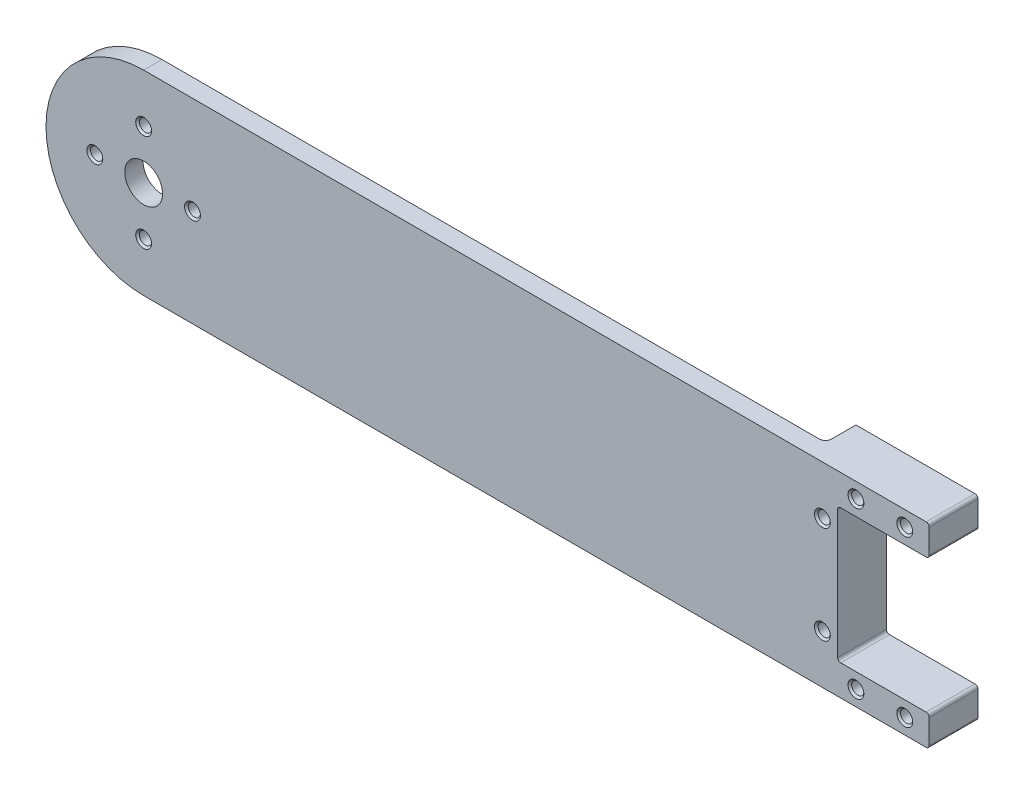
ISO-10303-21;
HEADER;
FILE_DESCRIPTION(('STEP AP214'),'2;1');
FILE_NAME('part.step','',(''),(''),'','','');
FILE_SCHEMA(('AUTOMOTIVE_DESIGN { 1 0 10303 214 1 1 1 1 }'));
ENDSEC;
DATA;
#1=APPLICATION_CONTEXT('core data for automotive mechanical design processes');
#2=APPLICATION_PROTOCOL_DEFINITION('international standard','automotive_design',2000,#1);
#3=PRODUCT_CONTEXT('',#1,'mechanical');
#4=PRODUCT('Part','Part','',(#3));
#5=PRODUCT_RELATED_PRODUCT_CATEGORY('part','',(#4));
#6=PRODUCT_DEFINITION_FORMATION('','',#4);
#7=PRODUCT_DEFINITION_CONTEXT('part definition',#1,'design');
#8=PRODUCT_DEFINITION('design','',#6,#7);
#9=PRODUCT_DEFINITION_SHAPE('','',#8);
#10=(LENGTH_UNIT() NAMED_UNIT(*) SI_UNIT(.MILLI.,.METRE.));
#11=(NAMED_UNIT(*) PLANE_ANGLE_UNIT() SI_UNIT($,.RADIAN.));
#12=(NAMED_UNIT(*) SI_UNIT($,.STERADIAN.) SOLID_ANGLE_UNIT());
#13=UNCERTAINTY_MEASURE_WITH_UNIT(LENGTH_MEASURE(1.E-05),#10,'distance_accuracy_value','');
#14=(GEOMETRIC_REPRESENTATION_CONTEXT(3) GLOBAL_UNCERTAINTY_ASSIGNED_CONTEXT((#13)) GLOBAL_UNIT_ASSIGNED_CONTEXT((#10,
#11,#12)) REPRESENTATION_CONTEXT('',''));
#15=CARTESIAN_POINT('',(0.,0.,0.));
#16=DIRECTION('',(0.,0.,1.));
#17=DIRECTION('',(1.,0.,0.));
#18=AXIS2_PLACEMENT_3D('',#15,#16,#17);
#19=CARTESIAN_POINT('',(0.,16.,3.));
#20=DIRECTION('',(0.,1.,0.));
#21=DIRECTION('',(0.,0.,1.));
#22=AXIS2_PLACEMENT_3D('',#19,#20,#21);
#23=PLANE('',#22);
#24=DIRECTION('',(1.,0.,0.));
#25=VECTOR('',#24,1.);
#26=CARTESIAN_POINT('',(0.,16.,3.));
#27=LINE('',#26,#25);
#28=CARTESIAN_POINT('',(-61.,16.,3.));
#29=VERTEX_POINT('',#28);
#30=CARTESIAN_POINT('',(67.1999999999998,16.,3.));
#31=VERTEX_POINT('',#30);
#32=EDGE_CURVE('E317',#29,#31,#27,.T.);
#33=ORIENTED_EDGE('',*,*,#32,.T.);
#34=DIRECTION('',(0.,0.,1.));
#35=VECTOR('',#34,1.);
#36=CARTESIAN_POINT('',(67.1999999999998,16.,-5.));
#37=LINE('',#36,#35);
#38=CARTESIAN_POINT('',(67.1999999999998,16.,-5.));
#39=VERTEX_POINT('',#38);
#40=EDGE_CURVE('E233',#31,#39,#37,.F.);
#41=ORIENTED_EDGE('',*,*,#40,.T.);
#42=DIRECTION('',(-1.,0.,0.));
#43=VECTOR('',#42,1.);
#44=CARTESIAN_POINT('',(0.,16.,-5.));
#45=LINE('',#44,#43);
#46=CARTESIAN_POINT('',(47.6999999999998,16.,-5.));
#47=VERTEX_POINT('',#46);
#48=EDGE_CURVE('E227',#39,#47,#45,.T.);
#49=ORIENTED_EDGE('',*,*,#48,.T.);
#50=DIRECTION('',(0.,0.,1.));
#51=VECTOR('',#50,1.);
#52=CARTESIAN_POINT('',(47.6999999999998,16.,-5.));
#53=LINE('',#52,#51);
#54=CARTESIAN_POINT('',(47.6999999999998,16.,-1.));
#55=VERTEX_POINT('',#54);
#56=EDGE_CURVE('E230',#47,#55,#53,.T.);
#57=ORIENTED_EDGE('',*,*,#56,.T.);
#58=CARTESIAN_POINT('',(46.6999999999998,16.,-1.));
#59=DIRECTION('',(0.,1.,0.));
#60=DIRECTION('',(0.,0.,1.));
#61=AXIS2_PLACEMENT_3D('',#58,#59,#60);
#62=CIRCLE('',#61,1.);
#63=CARTESIAN_POINT('',(46.6999999999998,16.,0.));
#64=VERTEX_POINT('',#63);
#65=EDGE_CURVE('E343',#55,#64,#62,.F.);
#66=ORIENTED_EDGE('',*,*,#65,.T.);
#67=DIRECTION('',(1.,0.,0.));
#68=VECTOR('',#67,1.);
#69=CARTESIAN_POINT('',(0.,16.,0.));
#70=LINE('',#69,#68);
#71=CARTESIAN_POINT('',(-61.,16.,0.));
#72=VERTEX_POINT('',#71);
#73=EDGE_CURVE('E324',#72,#64,#70,.T.);
#74=ORIENTED_EDGE('',*,*,#73,.F.);
#75=DIRECTION('',(0.,0.,-1.));
#76=VECTOR('',#75,1.);
#77=CARTESIAN_POINT('',(-61.,16.,3.));
#78=LINE('',#77,#76);
#79=EDGE_CURVE('E331',#29,#72,#78,.T.);
#80=ORIENTED_EDGE('',*,*,#79,.F.);
#81=EDGE_LOOP('',(#33,#41,#49,#57,#66,#74,#80));
#82=FACE_BOUND('',#81,.T.);
#83=ADVANCED_FACE('F108',(#82),#23,.T.);
#84=CARTESIAN_POINT('',(0.,-16.,3.));
#85=DIRECTION('',(0.,1.,0.));
#86=DIRECTION('',(0.,0.,1.));
#87=AXIS2_PLACEMENT_3D('',#84,#85,#86);
#88=PLANE('',#87);
#89=DIRECTION('',(1.,0.,0.));
#90=VECTOR('',#89,1.);
#91=CARTESIAN_POINT('',(0.,-16.,-5.));
#92=LINE('',#91,#90);
#93=CARTESIAN_POINT('',(47.6999999999998,-16.,-5.));
#94=VERTEX_POINT('',#93);
#95=CARTESIAN_POINT('',(67.1999999999998,-16.,-5.));
#96=VERTEX_POINT('',#95);
#97=EDGE_CURVE('E251',#94,#96,#92,.T.);
#98=ORIENTED_EDGE('',*,*,#97,.T.);
#99=DIRECTION('',(0.,0.,1.));
#100=VECTOR('',#99,1.);
#101=CARTESIAN_POINT('',(67.1999999999998,-16.,3.));
#102=LINE('',#101,#100);
#103=CARTESIAN_POINT('',(67.1999999999998,-16.,3.));
#104=VERTEX_POINT('',#103);
#105=EDGE_CURVE('E361',#96,#104,#102,.T.);
#106=ORIENTED_EDGE('',*,*,#105,.T.);
#107=DIRECTION('',(1.,0.,0.));
#108=VECTOR('',#107,1.);
#109=CARTESIAN_POINT('',(0.,-16.,3.));
#110=LINE('',#109,#108);
#111=CARTESIAN_POINT('',(-61.,-16.,3.));
#112=VERTEX_POINT('',#111);
#113=EDGE_CURVE('E319',#112,#104,#110,.T.);
#114=ORIENTED_EDGE('',*,*,#113,.F.);
#115=DIRECTION('',(0.,0.,-1.));
#116=VECTOR('',#115,1.);
#117=CARTESIAN_POINT('',(-61.,-16.,3.));
#118=LINE('',#117,#116);
#119=CARTESIAN_POINT('',(-61.,-16.,0.));
#120=VERTEX_POINT('',#119);
#121=EDGE_CURVE('E323',#112,#120,#118,.T.);
#122=ORIENTED_EDGE('',*,*,#121,.T.);
#123=DIRECTION('',(1.,0.,0.));
#124=VECTOR('',#123,1.);
#125=CARTESIAN_POINT('',(0.,-16.,0.));
#126=LINE('',#125,#124);
#127=CARTESIAN_POINT('',(46.6999999999998,-16.,0.));
#128=VERTEX_POINT('',#127);
#129=EDGE_CURVE('E320',#120,#128,#126,.T.);
#130=ORIENTED_EDGE('',*,*,#129,.T.);
#131=CARTESIAN_POINT('',(46.6999999999998,-16.,-1.));
#132=DIRECTION('',(0.,1.,0.));
#133=DIRECTION('',(0.,0.,1.));
#134=AXIS2_PLACEMENT_3D('',#131,#132,#133);
#135=CIRCLE('',#134,1.);
#136=CARTESIAN_POINT('',(47.6999999999998,-16.,-1.));
#137=VERTEX_POINT('',#136);
#138=EDGE_CURVE('E341',#128,#137,#135,.T.);
#139=ORIENTED_EDGE('',*,*,#138,.T.);
#140=DIRECTION('',(0.,0.,1.));
#141=VECTOR('',#140,1.);
#142=CARTESIAN_POINT('',(47.6999999999998,-16.,-5.));
#143=LINE('',#142,#141);
#144=EDGE_CURVE('E244',#94,#137,#143,.T.);
#145=ORIENTED_EDGE('',*,*,#144,.F.);
#146=EDGE_LOOP('',(#98,#106,#114,#122,#130,#139,#145));
#147=FACE_BOUND('',#146,.T.);
#148=ADVANCED_FACE('F534',(#147),#88,.F.);
#149=CARTESIAN_POINT('',(0.,0.,0.));
#150=DIRECTION('',(0.,0.,1.));
#151=DIRECTION('',(1.,0.,0.));
#152=AXIS2_PLACEMENT_3D('',#149,#150,#151);
#153=PLANE('',#152);
#154=CARTESIAN_POINT('',(-61.,8.,0.));
#155=DIRECTION('',(0.,0.,1.));
#156=DIRECTION('',(1.,0.,0.));
#157=AXIS2_PLACEMENT_3D('',#154,#155,#156);
#158=CIRCLE('',#157,1.);
#159=CARTESIAN_POINT('',(-60.,8.,0.));
#160=VERTEX_POINT('',#159);
#161=EDGE_CURVE('E280',#160,#160,#158,.T.);
#162=ORIENTED_EDGE('',*,*,#161,.T.);
#163=EDGE_LOOP('',(#162));
#164=FACE_BOUND('',#163,.T.);
#165=CARTESIAN_POINT('',(-53.,0.,0.));
#166=DIRECTION('',(0.,0.,1.));
#167=DIRECTION('',(1.,0.,0.));
#168=AXIS2_PLACEMENT_3D('',#165,#166,#167);
#169=CIRCLE('',#168,1.);
#170=CARTESIAN_POINT('',(-52.,0.,0.));
#171=VERTEX_POINT('',#170);
#172=EDGE_CURVE('E289',#171,#171,#169,.T.);
#173=ORIENTED_EDGE('',*,*,#172,.T.);
#174=EDGE_LOOP('',(#173));
#175=FACE_BOUND('',#174,.T.);
#176=CARTESIAN_POINT('',(-61.,-8.,0.));
#177=DIRECTION('',(0.,0.,1.));
#178=DIRECTION('',(1.,0.,0.));
#179=AXIS2_PLACEMENT_3D('',#176,#177,#178);
#180=CIRCLE('',#179,1.);
#181=CARTESIAN_POINT('',(-60.,-8.,0.));
#182=VERTEX_POINT('',#181);
#183=EDGE_CURVE('E298',#182,#182,#180,.T.);
#184=ORIENTED_EDGE('',*,*,#183,.T.);
#185=EDGE_LOOP('',(#184));
#186=FACE_BOUND('',#185,.T.);
#187=CARTESIAN_POINT('',(-69.,0.,0.));
#188=DIRECTION('',(0.,0.,1.));
#189=DIRECTION('',(1.,0.,0.));
#190=AXIS2_PLACEMENT_3D('',#187,#188,#189);
#191=CIRCLE('',#190,1.);
#192=CARTESIAN_POINT('',(-68.,0.,0.));
#193=VERTEX_POINT('',#192);
#194=EDGE_CURVE('E307',#193,#193,#191,.T.);
#195=ORIENTED_EDGE('',*,*,#194,.T.);
#196=EDGE_LOOP('',(#195));
#197=FACE_BOUND('',#196,.T.);
#198=CARTESIAN_POINT('',(-61.,0.,0.));
#199=DIRECTION('',(0.,0.,1.));
#200=DIRECTION('',(1.,0.,0.));
#201=AXIS2_PLACEMENT_3D('',#198,#199,#200);
#202=CIRCLE('',#201,3.1);
#203=CARTESIAN_POINT('',(-57.9,0.,0.));
#204=VERTEX_POINT('',#203);
#205=EDGE_CURVE('E311',#204,#204,#202,.T.);
#206=ORIENTED_EDGE('',*,*,#205,.T.);
#207=EDGE_LOOP('',(#206));
#208=FACE_BOUND('',#207,.T.);
#209=ORIENTED_EDGE('',*,*,#73,.T.);
#210=DIRECTION('',(0.,-1.,0.));
#211=VECTOR('',#210,1.);
#212=CARTESIAN_POINT('',(46.6999999999998,0.,0.));
#213=LINE('',#212,#211);
#214=EDGE_CURVE('E333',#64,#128,#213,.T.);
#215=ORIENTED_EDGE('',*,*,#214,.T.);
#216=ORIENTED_EDGE('',*,*,#129,.F.);
#217=CARTESIAN_POINT('',(-61.,0.,0.));
#218=DIRECTION('',(0.,0.,1.));
#219=DIRECTION('',(1.,0.,0.));
#220=AXIS2_PLACEMENT_3D('',#217,#218,#219);
#221=CIRCLE('',#220,16.);
#222=EDGE_CURVE('E314',#72,#120,#221,.T.);
#223=ORIENTED_EDGE('',*,*,#222,.F.);
#224=EDGE_LOOP('',(#209,#215,#216,#223));
#225=FACE_BOUND('',#224,.T.);
#226=ADVANCED_FACE('F506',(#164,#175,#186,#197,#208,#225),#153,.F.);
#227=CARTESIAN_POINT('',(0.,0.,3.));
#228=DIRECTION('',(0.,0.,1.));
#229=DIRECTION('',(1.,0.,0.));
#230=AXIS2_PLACEMENT_3D('',#227,#228,#229);
#231=PLANE('',#230);
#232=ORIENTED_EDGE('',*,*,#113,.T.);
#233=CARTESIAN_POINT('',(67.1999999999998,-15.5,3.));
#234=DIRECTION('',(0.,0.,1.));
#235=DIRECTION('',(1.,0.,0.));
#236=AXIS2_PLACEMENT_3D('',#233,#234,#235);
#237=CIRCLE('',#236,0.5);
#238=CARTESIAN_POINT('',(67.6999999999998,-15.5,3.));
#239=VERTEX_POINT('',#238);
#240=EDGE_CURVE('E370',#104,#239,#237,.T.);
#241=ORIENTED_EDGE('',*,*,#240,.T.);
#242=DIRECTION('',(0.,-1.,0.));
#243=VECTOR('',#242,1.);
#244=CARTESIAN_POINT('',(67.6999999999998,16.,3.));
#245=LINE('',#244,#243);
#246=CARTESIAN_POINT('',(67.6999999999998,-11.5,3.));
#247=VERTEX_POINT('',#246);
#248=EDGE_CURVE('E434',#247,#239,#245,.T.);
#249=ORIENTED_EDGE('',*,*,#248,.F.);
#250=CARTESIAN_POINT('',(67.1999999999998,-11.5,3.));
#251=DIRECTION('',(0.,0.,1.));
#252=DIRECTION('',(1.,0.,0.));
#253=AXIS2_PLACEMENT_3D('',#250,#251,#252);
#254=CIRCLE('',#253,0.5);
#255=CARTESIAN_POINT('',(67.1999999999998,-11.,3.));
#256=VERTEX_POINT('',#255);
#257=EDGE_CURVE('E368',#247,#256,#254,.T.);
#258=ORIENTED_EDGE('',*,*,#257,.T.);
#259=DIRECTION('',(1.,0.,0.));
#260=VECTOR('',#259,1.);
#261=CARTESIAN_POINT('',(74.9999999999998,-11.,3.));
#262=LINE('',#261,#260);
#263=CARTESIAN_POINT('',(53.1999999999998,-11.,3.));
#264=VERTEX_POINT('',#263);
#265=EDGE_CURVE('E271',#264,#256,#262,.T.);
#266=ORIENTED_EDGE('',*,*,#265,.F.);
#267=CARTESIAN_POINT('',(53.1999999999998,-10.5,3.));
#268=DIRECTION('',(0.,0.,1.));
#269=DIRECTION('',(1.,0.,0.));
#270=AXIS2_PLACEMENT_3D('',#267,#268,#269);
#271=CIRCLE('',#270,0.5);
#272=CARTESIAN_POINT('',(52.6999999999998,-10.5,3.));
#273=VERTEX_POINT('',#272);
#274=EDGE_CURVE('E388',#264,#273,#271,.F.);
#275=ORIENTED_EDGE('',*,*,#274,.T.);
#276=DIRECTION('',(0.,-1.,0.));
#277=VECTOR('',#276,1.);
#278=CARTESIAN_POINT('',(52.6999999999998,11.,3.));
#279=LINE('',#278,#277);
#280=CARTESIAN_POINT('',(52.6999999999998,10.5,3.));
#281=VERTEX_POINT('',#280);
#282=EDGE_CURVE('E268',#281,#273,#279,.T.);
#283=ORIENTED_EDGE('',*,*,#282,.F.);
#284=CARTESIAN_POINT('',(53.1999999999998,10.5,3.));
#285=DIRECTION('',(0.,0.,1.));
#286=DIRECTION('',(1.,0.,0.));
#287=AXIS2_PLACEMENT_3D('',#284,#285,#286);
#288=CIRCLE('',#287,0.5);
#289=CARTESIAN_POINT('',(53.1999999999998,11.,3.));
#290=VERTEX_POINT('',#289);
#291=EDGE_CURVE('E116',#281,#290,#288,.F.);
#292=ORIENTED_EDGE('',*,*,#291,.T.);
#293=DIRECTION('',(-1.,0.,0.));
#294=VECTOR('',#293,1.);
#295=CARTESIAN_POINT('',(74.9999999999998,11.,3.));
#296=LINE('',#295,#294);
#297=CARTESIAN_POINT('',(67.1999999999998,11.,3.));
#298=VERTEX_POINT('',#297);
#299=EDGE_CURVE('E264',#298,#290,#296,.T.);
#300=ORIENTED_EDGE('',*,*,#299,.F.);
#301=CARTESIAN_POINT('',(67.1999999999998,11.5,3.));
#302=DIRECTION('',(0.,0.,1.));
#303=DIRECTION('',(1.,0.,0.));
#304=AXIS2_PLACEMENT_3D('',#301,#302,#303);
#305=CIRCLE('',#304,0.5);
#306=CARTESIAN_POINT('',(67.6999999999998,11.5,3.));
#307=VERTEX_POINT('',#306);
#308=EDGE_CURVE('E366',#298,#307,#305,.T.);
#309=ORIENTED_EDGE('',*,*,#308,.T.);
#310=CARTESIAN_POINT('',(67.6999999999998,15.5,3.));
#311=VERTEX_POINT('',#310);
#312=EDGE_CURVE('E431',#311,#307,#245,.T.);
#313=ORIENTED_EDGE('',*,*,#312,.F.);
#314=CARTESIAN_POINT('',(67.1999999999998,15.5,3.));
#315=DIRECTION('',(0.,0.,1.));
#316=DIRECTION('',(1.,0.,0.));
#317=AXIS2_PLACEMENT_3D('',#314,#315,#316);
#318=CIRCLE('',#317,0.5);
#319=EDGE_CURVE('E364',#311,#31,#318,.T.);
#320=ORIENTED_EDGE('',*,*,#319,.T.);
#321=ORIENTED_EDGE('',*,*,#32,.F.);
#322=CARTESIAN_POINT('',(-61.,0.,3.));
#323=DIRECTION('',(0.,0.,1.));
#324=DIRECTION('',(1.,0.,0.));
#325=AXIS2_PLACEMENT_3D('',#322,#323,#324);
#326=CIRCLE('',#325,16.);
#327=EDGE_CURVE('E327',#29,#112,#326,.T.);
#328=ORIENTED_EDGE('',*,*,#327,.T.);
#329=EDGE_LOOP('',(#232,#241,#249,#258,#266,#275,#283,#292,#300,#309,#313,#320,#321,#328));
#330=FACE_BOUND('',#329,.T.);
#331=CARTESIAN_POINT('',(63.6999999999998,13.5,3.));
#332=DIRECTION('',(0.,0.,1.));
#333=DIRECTION('',(1.,0.,0.));
#334=AXIS2_PLACEMENT_3D('',#331,#332,#333);
#335=CIRCLE('',#334,1.3);
#336=CARTESIAN_POINT('',(64.9999999999998,13.5,3.));
#337=VERTEX_POINT('',#336);
#338=EDGE_CURVE('E433',#337,#337,#335,.T.);
#339=ORIENTED_EDGE('',*,*,#338,.F.);
#340=EDGE_LOOP('',(#339));
#341=FACE_BOUND('',#340,.T.);
#342=CARTESIAN_POINT('',(55.6999999999998,13.5,3.));
#343=DIRECTION('',(0.,0.,1.));
#344=DIRECTION('',(1.,0.,0.));
#345=AXIS2_PLACEMENT_3D('',#342,#343,#344);
#346=CIRCLE('',#345,1.3);
#347=CARTESIAN_POINT('',(56.9999999999998,13.5,3.));
#348=VERTEX_POINT('',#347);
#349=EDGE_CURVE('E445',#348,#348,#346,.T.);
#350=ORIENTED_EDGE('',*,*,#349,.F.);
#351=EDGE_LOOP('',(#350));
#352=FACE_BOUND('',#351,.T.);
#353=CARTESIAN_POINT('',(50.1999999999998,8.,3.));
#354=DIRECTION('',(0.,0.,1.));
#355=DIRECTION('',(1.,0.,0.));
#356=AXIS2_PLACEMENT_3D('',#353,#354,#355);
#357=CIRCLE('',#356,1.3);
#358=CARTESIAN_POINT('',(51.4999999999998,8.,3.));
#359=VERTEX_POINT('',#358);
#360=EDGE_CURVE('E454',#359,#359,#357,.T.);
#361=ORIENTED_EDGE('',*,*,#360,.F.);
#362=EDGE_LOOP('',(#361));
#363=FACE_BOUND('',#362,.T.);
#364=CARTESIAN_POINT('',(50.1999999999998,-8.,3.));
#365=DIRECTION('',(0.,0.,1.));
#366=DIRECTION('',(1.,0.,0.));
#367=AXIS2_PLACEMENT_3D('',#364,#365,#366);
#368=CIRCLE('',#367,1.3);
#369=CARTESIAN_POINT('',(51.4999999999998,-8.,3.));
#370=VERTEX_POINT('',#369);
#371=EDGE_CURVE('E463',#370,#370,#368,.T.);
#372=ORIENTED_EDGE('',*,*,#371,.F.);
#373=EDGE_LOOP('',(#372));
#374=FACE_BOUND('',#373,.T.);
#375=CARTESIAN_POINT('',(55.6999999999998,-13.5,3.));
#376=DIRECTION('',(0.,0.,1.));
#377=DIRECTION('',(1.,0.,0.));
#378=AXIS2_PLACEMENT_3D('',#375,#376,#377);
#379=CIRCLE('',#378,1.3);
#380=CARTESIAN_POINT('',(56.9999999999998,-13.5,3.));
#381=VERTEX_POINT('',#380);
#382=EDGE_CURVE('E472',#381,#381,#379,.T.);
#383=ORIENTED_EDGE('',*,*,#382,.F.);
#384=EDGE_LOOP('',(#383));
#385=FACE_BOUND('',#384,.T.);
#386=CARTESIAN_POINT('',(63.6999999999998,-13.5,3.));
#387=DIRECTION('',(0.,0.,1.));
#388=DIRECTION('',(1.,0.,0.));
#389=AXIS2_PLACEMENT_3D('',#386,#387,#388);
#390=CIRCLE('',#389,1.3);
#391=CARTESIAN_POINT('',(64.9999999999998,-13.5,3.));
#392=VERTEX_POINT('',#391);
#393=EDGE_CURVE('E481',#392,#392,#390,.T.);
#394=ORIENTED_EDGE('',*,*,#393,.F.);
#395=EDGE_LOOP('',(#394));
#396=FACE_BOUND('',#395,.T.);
#397=CARTESIAN_POINT('',(-61.,8.,3.));
#398=DIRECTION('',(0.,0.,1.));
#399=DIRECTION('',(1.,0.,0.));
#400=AXIS2_PLACEMENT_3D('',#397,#398,#399);
#401=CIRCLE('',#400,1.3);
#402=CARTESIAN_POINT('',(-59.7,8.,3.));
#403=VERTEX_POINT('',#402);
#404=EDGE_CURVE('E274',#403,#403,#401,.T.);
#405=ORIENTED_EDGE('',*,*,#404,.F.);
#406=EDGE_LOOP('',(#405));
#407=FACE_BOUND('',#406,.T.);
#408=CARTESIAN_POINT('',(-53.,0.,3.));
#409=DIRECTION('',(0.,0.,1.));
#410=DIRECTION('',(1.,0.,0.));
#411=AXIS2_PLACEMENT_3D('',#408,#409,#410);
#412=CIRCLE('',#411,1.3);
#413=CARTESIAN_POINT('',(-51.7,0.,3.));
#414=VERTEX_POINT('',#413);
#415=EDGE_CURVE('E283',#414,#414,#412,.T.);
#416=ORIENTED_EDGE('',*,*,#415,.F.);
#417=EDGE_LOOP('',(#416));
#418=FACE_BOUND('',#417,.T.);
#419=CARTESIAN_POINT('',(-61.,-8.,3.));
#420=DIRECTION('',(0.,0.,1.));
#421=DIRECTION('',(1.,0.,0.));
#422=AXIS2_PLACEMENT_3D('',#419,#420,#421);
#423=CIRCLE('',#422,1.3);
#424=CARTESIAN_POINT('',(-59.7,-8.,3.));
#425=VERTEX_POINT('',#424);
#426=EDGE_CURVE('E292',#425,#425,#423,.T.);
#427=ORIENTED_EDGE('',*,*,#426,.F.);
#428=EDGE_LOOP('',(#427));
#429=FACE_BOUND('',#428,.T.);
#430=CARTESIAN_POINT('',(-69.,0.,3.));
#431=DIRECTION('',(0.,0.,1.));
#432=DIRECTION('',(1.,0.,0.));
#433=AXIS2_PLACEMENT_3D('',#430,#431,#432);
#434=CIRCLE('',#433,1.3);
#435=CARTESIAN_POINT('',(-67.7,0.,3.));
#436=VERTEX_POINT('',#435);
#437=EDGE_CURVE('E301',#436,#436,#434,.T.);
#438=ORIENTED_EDGE('',*,*,#437,.F.);
#439=EDGE_LOOP('',(#438));
#440=FACE_BOUND('',#439,.T.);
#441=CARTESIAN_POINT('',(-61.,0.,3.));
#442=DIRECTION('',(0.,0.,1.));
#443=DIRECTION('',(1.,0.,0.));
#444=AXIS2_PLACEMENT_3D('',#441,#442,#443);
#445=CIRCLE('',#444,3.1);
#446=CARTESIAN_POINT('',(-57.9,0.,3.));
#447=VERTEX_POINT('',#446);
#448=EDGE_CURVE('E310',#447,#447,#445,.T.);
#449=ORIENTED_EDGE('',*,*,#448,.F.);
#450=EDGE_LOOP('',(#449));
#451=FACE_BOUND('',#450,.T.);
#452=ADVANCED_FACE('F394',(#330,#341,#352,#363,#374,#385,#396,#407,#418,#429,#440,#451),#231,.T.);
#453=CARTESIAN_POINT('',(-61.,0.,3.));
#454=DIRECTION('',(0.,0.,-1.));
#455=DIRECTION('',(-1.,0.,0.));
#456=AXIS2_PLACEMENT_3D('',#453,#454,#455);
#457=CYLINDRICAL_SURFACE('',#456,16.);
#458=ORIENTED_EDGE('',*,*,#327,.F.);
#459=ORIENTED_EDGE('',*,*,#79,.T.);
#460=ORIENTED_EDGE('',*,*,#222,.T.);
#461=ORIENTED_EDGE('',*,*,#121,.F.);
#462=EDGE_LOOP('',(#458,#459,#460,#461));
#463=FACE_BOUND('',#462,.T.);
#464=ADVANCED_FACE('F505',(#463),#457,.T.);
#465=CARTESIAN_POINT('',(-61.,0.,0.));
#466=DIRECTION('',(0.,0.,1.));
#467=DIRECTION('',(1.,0.,0.));
#468=AXIS2_PLACEMENT_3D('',#465,#466,#467);
#469=CYLINDRICAL_SURFACE('',#468,3.1);
#470=ORIENTED_EDGE('',*,*,#205,.F.);
#471=EDGE_LOOP('',(#470));
#472=FACE_BOUND('',#471,.T.);
#473=ORIENTED_EDGE('',*,*,#448,.T.);
#474=EDGE_LOOP('',(#473));
#475=FACE_BOUND('',#474,.T.);
#476=ADVANCED_FACE('F518',(#472,#475),#469,.F.);
#477=CARTESIAN_POINT('',(-69.,0.,3.));
#478=DIRECTION('',(0.,0.,1.));
#479=DIRECTION('',(1.,0.,0.));
#480=AXIS2_PLACEMENT_3D('',#477,#478,#479);
#481=CYLINDRICAL_SURFACE('',#480,1.);
#482=ORIENTED_EDGE('',*,*,#194,.F.);
#483=EDGE_LOOP('',(#482));
#484=FACE_BOUND('',#483,.T.);
#485=CARTESIAN_POINT('',(-69.,0.,2.7));
#486=DIRECTION('',(0.,0.,1.));
#487=DIRECTION('',(1.,0.,0.));
#488=AXIS2_PLACEMENT_3D('',#485,#486,#487);
#489=CIRCLE('',#488,1.);
#490=CARTESIAN_POINT('',(-68.,0.,2.7));
#491=VERTEX_POINT('',#490);
#492=EDGE_CURVE('E304',#491,#491,#489,.T.);
#493=ORIENTED_EDGE('',*,*,#492,.T.);
#494=EDGE_LOOP('',(#493));
#495=FACE_BOUND('',#494,.T.);
#496=ADVANCED_FACE('F520',(#484,#495),#481,.F.);
#497=CARTESIAN_POINT('',(-69.,0.,3.));
#498=DIRECTION('',(0.,0.,1.));
#499=DIRECTION('',(1.,0.,0.));
#500=AXIS2_PLACEMENT_3D('',#497,#498,#499);
#501=CONICAL_SURFACE('',#500,1.3,0.785398163397437);
#502=ORIENTED_EDGE('',*,*,#492,.F.);
#503=EDGE_LOOP('',(#502));
#504=FACE_BOUND('',#503,.T.);
#505=ORIENTED_EDGE('',*,*,#437,.T.);
#506=EDGE_LOOP('',(#505));
#507=FACE_BOUND('',#506,.T.);
#508=ADVANCED_FACE('F527',(#504,#507),#501,.F.);
#509=CARTESIAN_POINT('',(-61.,-8.,3.));
#510=DIRECTION('',(0.,0.,1.));
#511=DIRECTION('',(1.,0.,0.));
#512=AXIS2_PLACEMENT_3D('',#509,#510,#511);
#513=CYLINDRICAL_SURFACE('',#512,1.);
#514=ORIENTED_EDGE('',*,*,#183,.F.);
#515=EDGE_LOOP('',(#514));
#516=FACE_BOUND('',#515,.T.);
#517=CARTESIAN_POINT('',(-61.,-8.,2.7));
#518=DIRECTION('',(0.,0.,1.));
#519=DIRECTION('',(1.,0.,0.));
#520=AXIS2_PLACEMENT_3D('',#517,#518,#519);
#521=CIRCLE('',#520,1.);
#522=CARTESIAN_POINT('',(-60.,-8.,2.7));
#523=VERTEX_POINT('',#522);
#524=EDGE_CURVE('E295',#523,#523,#521,.T.);
#525=ORIENTED_EDGE('',*,*,#524,.T.);
#526=EDGE_LOOP('',(#525));
#527=FACE_BOUND('',#526,.T.);
#528=ADVANCED_FACE('F594',(#516,#527),#513,.F.);
#529=CARTESIAN_POINT('',(-61.,-8.,3.));
#530=DIRECTION('',(0.,0.,1.));
#531=DIRECTION('',(1.,0.,0.));
#532=AXIS2_PLACEMENT_3D('',#529,#530,#531);
#533=CONICAL_SURFACE('',#532,1.3,0.785398163397448);
#534=ORIENTED_EDGE('',*,*,#524,.F.);
#535=EDGE_LOOP('',(#534));
#536=FACE_BOUND('',#535,.T.);
#537=ORIENTED_EDGE('',*,*,#426,.T.);
#538=EDGE_LOOP('',(#537));
#539=FACE_BOUND('',#538,.T.);
#540=ADVANCED_FACE('F599',(#536,#539),#533,.F.);
#541=CARTESIAN_POINT('',(-53.,0.,3.));
#542=DIRECTION('',(0.,0.,1.));
#543=DIRECTION('',(1.,0.,0.));
#544=AXIS2_PLACEMENT_3D('',#541,#542,#543);
#545=CYLINDRICAL_SURFACE('',#544,1.);
#546=ORIENTED_EDGE('',*,*,#172,.F.);
#547=EDGE_LOOP('',(#546));
#548=FACE_BOUND('',#547,.T.);
#549=CARTESIAN_POINT('',(-53.,0.,2.7));
#550=DIRECTION('',(0.,0.,1.));
#551=DIRECTION('',(1.,0.,0.));
#552=AXIS2_PLACEMENT_3D('',#549,#550,#551);
#553=CIRCLE('',#552,1.);
#554=CARTESIAN_POINT('',(-52.,0.,2.7));
#555=VERTEX_POINT('',#554);
#556=EDGE_CURVE('E286',#555,#555,#553,.T.);
#557=ORIENTED_EDGE('',*,*,#556,.T.);
#558=EDGE_LOOP('',(#557));
#559=FACE_BOUND('',#558,.T.);
#560=ADVANCED_FACE('F605',(#548,#559),#545,.F.);
#561=CARTESIAN_POINT('',(-53.,0.,3.));
#562=DIRECTION('',(0.,0.,1.));
#563=DIRECTION('',(1.,0.,0.));
#564=AXIS2_PLACEMENT_3D('',#561,#562,#563);
#565=CONICAL_SURFACE('',#564,1.3,0.785398163397448);
#566=ORIENTED_EDGE('',*,*,#556,.F.);
#567=EDGE_LOOP('',(#566));
#568=FACE_BOUND('',#567,.T.);
#569=ORIENTED_EDGE('',*,*,#415,.T.);
#570=EDGE_LOOP('',(#569));
#571=FACE_BOUND('',#570,.T.);
#572=ADVANCED_FACE('F609',(#568,#571),#565,.F.);
#573=CARTESIAN_POINT('',(-61.,8.,3.));
#574=DIRECTION('',(0.,0.,1.));
#575=DIRECTION('',(1.,0.,0.));
#576=AXIS2_PLACEMENT_3D('',#573,#574,#575);
#577=CYLINDRICAL_SURFACE('',#576,1.);
#578=ORIENTED_EDGE('',*,*,#161,.F.);
#579=EDGE_LOOP('',(#578));
#580=FACE_BOUND('',#579,.T.);
#581=CARTESIAN_POINT('',(-61.,8.,2.7));
#582=DIRECTION('',(0.,0.,1.));
#583=DIRECTION('',(1.,0.,0.));
#584=AXIS2_PLACEMENT_3D('',#581,#582,#583);
#585=CIRCLE('',#584,1.);
#586=CARTESIAN_POINT('',(-60.,8.,2.7));
#587=VERTEX_POINT('',#586);
#588=EDGE_CURVE('E277',#587,#587,#585,.T.);
#589=ORIENTED_EDGE('',*,*,#588,.T.);
#590=EDGE_LOOP('',(#589));
#591=FACE_BOUND('',#590,.T.);
#592=ADVANCED_FACE('F613',(#580,#591),#577,.F.);
#593=CARTESIAN_POINT('',(-61.,8.,3.));
#594=DIRECTION('',(0.,0.,1.));
#595=DIRECTION('',(1.,0.,0.));
#596=AXIS2_PLACEMENT_3D('',#593,#594,#595);
#597=CONICAL_SURFACE('',#596,1.3,0.785398163397448);
#598=ORIENTED_EDGE('',*,*,#588,.F.);
#599=EDGE_LOOP('',(#598));
#600=FACE_BOUND('',#599,.T.);
#601=ORIENTED_EDGE('',*,*,#404,.T.);
#602=EDGE_LOOP('',(#601));
#603=FACE_BOUND('',#602,.T.);
#604=ADVANCED_FACE('F617',(#600,#603),#597,.F.);
#605=CARTESIAN_POINT('',(74.9999999999998,-11.,0.));
#606=DIRECTION('',(0.,-1.,0.));
#607=DIRECTION('',(1.,0.,0.));
#608=AXIS2_PLACEMENT_3D('',#605,#606,#607);
#609=PLANE('',#608);
#610=DIRECTION('',(-1.,0.,0.));
#611=VECTOR('',#610,1.);
#612=CARTESIAN_POINT('',(0.,-11.,-5.));
#613=LINE('',#612,#611);
#614=CARTESIAN_POINT('',(67.1999999999998,-11.,-5.));
#615=VERTEX_POINT('',#614);
#616=CARTESIAN_POINT('',(53.1999999999998,-11.,-5.));
#617=VERTEX_POINT('',#616);
#618=EDGE_CURVE('E253',#615,#617,#613,.T.);
#619=ORIENTED_EDGE('',*,*,#618,.T.);
#620=DIRECTION('',(0.,0.,1.));
#621=VECTOR('',#620,1.);
#622=CARTESIAN_POINT('',(53.1999999999998,-11.,3.));
#623=LINE('',#622,#621);
#624=EDGE_CURVE('E348',#617,#264,#623,.T.);
#625=ORIENTED_EDGE('',*,*,#624,.T.);
#626=ORIENTED_EDGE('',*,*,#265,.T.);
#627=DIRECTION('',(0.,0.,-1.));
#628=VECTOR('',#627,1.);
#629=CARTESIAN_POINT('',(67.1999999999998,-11.,0.));
#630=LINE('',#629,#628);
#631=EDGE_CURVE('E345',#256,#615,#630,.T.);
#632=ORIENTED_EDGE('',*,*,#631,.T.);
#633=EDGE_LOOP('',(#619,#625,#626,#632));
#634=FACE_BOUND('',#633,.T.);
#635=ADVANCED_FACE('F415',(#634),#609,.F.);
#636=CARTESIAN_POINT('',(52.6999999999998,11.,0.));
#637=DIRECTION('',(-1.,0.,0.));
#638=DIRECTION('',(0.,-1.,0.));
#639=AXIS2_PLACEMENT_3D('',#636,#637,#638);
#640=PLANE('',#639);
#641=ORIENTED_EDGE('',*,*,#282,.T.);
#642=DIRECTION('',(0.,0.,1.));
#643=VECTOR('',#642,1.);
#644=CARTESIAN_POINT('',(52.6999999999998,-10.5,-5.));
#645=LINE('',#644,#643);
#646=CARTESIAN_POINT('',(52.6999999999998,-10.5,-5.));
#647=VERTEX_POINT('',#646);
#648=EDGE_CURVE('E354',#273,#647,#645,.F.);
#649=ORIENTED_EDGE('',*,*,#648,.T.);
#650=DIRECTION('',(0.,1.,0.));
#651=VECTOR('',#650,1.);
#652=CARTESIAN_POINT('',(52.6999999999998,0.,-5.));
#653=LINE('',#652,#651);
#654=CARTESIAN_POINT('',(52.6999999999998,10.5,-5.));
#655=VERTEX_POINT('',#654);
#656=EDGE_CURVE('E259',#647,#655,#653,.T.);
#657=ORIENTED_EDGE('',*,*,#656,.T.);
#658=DIRECTION('',(0.,0.,1.));
#659=VECTOR('',#658,1.);
#660=CARTESIAN_POINT('',(52.6999999999998,10.5,3.));
#661=LINE('',#660,#659);
#662=EDGE_CURVE('E351',#655,#281,#661,.T.);
#663=ORIENTED_EDGE('',*,*,#662,.T.);
#664=EDGE_LOOP('',(#641,#649,#657,#663));
#665=FACE_BOUND('',#664,.T.);
#666=ADVANCED_FACE('F408',(#665),#640,.F.);
#667=CARTESIAN_POINT('',(74.9999999999998,11.,0.));
#668=DIRECTION('',(0.,1.,0.));
#669=DIRECTION('',(-1.,0.,0.));
#670=AXIS2_PLACEMENT_3D('',#667,#668,#669);
#671=PLANE('',#670);
#672=ORIENTED_EDGE('',*,*,#299,.T.);
#673=DIRECTION('',(0.,0.,1.));
#674=VECTOR('',#673,1.);
#675=CARTESIAN_POINT('',(53.1999999999998,11.,-5.));
#676=LINE('',#675,#674);
#677=CARTESIAN_POINT('',(53.1999999999998,11.,-5.));
#678=VERTEX_POINT('',#677);
#679=EDGE_CURVE('E359',#290,#678,#676,.F.);
#680=ORIENTED_EDGE('',*,*,#679,.T.);
#681=DIRECTION('',(1.,0.,0.));
#682=VECTOR('',#681,1.);
#683=CARTESIAN_POINT('',(0.,11.,-5.));
#684=LINE('',#683,#682);
#685=CARTESIAN_POINT('',(67.1999999999998,11.,-5.));
#686=VERTEX_POINT('',#685);
#687=EDGE_CURVE('E245',#678,#686,#684,.T.);
#688=ORIENTED_EDGE('',*,*,#687,.T.);
#689=DIRECTION('',(0.,0.,1.));
#690=VECTOR('',#689,1.);
#691=CARTESIAN_POINT('',(67.1999999999998,11.,0.));
#692=LINE('',#691,#690);
#693=EDGE_CURVE('E356',#686,#298,#692,.T.);
#694=ORIENTED_EDGE('',*,*,#693,.T.);
#695=EDGE_LOOP('',(#672,#680,#688,#694));
#696=FACE_BOUND('',#695,.T.);
#697=ADVANCED_FACE('F400',(#696),#671,.F.);
#698=CARTESIAN_POINT('',(47.6999999999998,0.,-5.));
#699=DIRECTION('',(-1.,0.,0.));
#700=DIRECTION('',(0.,-1.,0.));
#701=AXIS2_PLACEMENT_3D('',#698,#699,#700);
#702=PLANE('',#701);
#703=ORIENTED_EDGE('',*,*,#144,.T.);
#704=DIRECTION('',(0.,-1.,0.));
#705=VECTOR('',#704,1.);
#706=CARTESIAN_POINT('',(47.6999999999998,0.,-1.));
#707=LINE('',#706,#705);
#708=EDGE_CURVE('E243',#137,#55,#707,.F.);
#709=ORIENTED_EDGE('',*,*,#708,.T.);
#710=ORIENTED_EDGE('',*,*,#56,.F.);
#711=DIRECTION('',(0.,-1.,0.));
#712=VECTOR('',#711,1.);
#713=CARTESIAN_POINT('',(47.6999999999998,0.,-5.));
#714=LINE('',#713,#712);
#715=EDGE_CURVE('E235',#47,#94,#714,.T.);
#716=ORIENTED_EDGE('',*,*,#715,.T.);
#717=EDGE_LOOP('',(#703,#709,#710,#716));
#718=FACE_BOUND('',#717,.T.);
#719=ADVANCED_FACE('F241',(#718),#702,.T.);
#720=CARTESIAN_POINT('',(0.,0.,-5.));
#721=DIRECTION('',(0.,0.,1.));
#722=DIRECTION('',(1.,0.,0.));
#723=AXIS2_PLACEMENT_3D('',#720,#721,#722);
#724=PLANE('',#723);
#725=CARTESIAN_POINT('',(63.6999999999998,13.5,-5.));
#726=DIRECTION('',(0.,0.,1.));
#727=DIRECTION('',(1.,0.,0.));
#728=AXIS2_PLACEMENT_3D('',#725,#726,#727);
#729=CIRCLE('',#728,1.);
#730=CARTESIAN_POINT('',(64.6999999999998,13.5,-5.));
#731=VERTEX_POINT('',#730);
#732=EDGE_CURVE('E442',#731,#731,#729,.T.);
#733=ORIENTED_EDGE('',*,*,#732,.T.);
#734=EDGE_LOOP('',(#733));
#735=FACE_BOUND('',#734,.T.);
#736=CARTESIAN_POINT('',(55.6999999999998,13.5,-5.));
#737=DIRECTION('',(0.,0.,1.));
#738=DIRECTION('',(1.,0.,0.));
#739=AXIS2_PLACEMENT_3D('',#736,#737,#738);
#740=CIRCLE('',#739,1.);
#741=CARTESIAN_POINT('',(56.6999999999998,13.5,-5.));
#742=VERTEX_POINT('',#741);
#743=EDGE_CURVE('E451',#742,#742,#740,.T.);
#744=ORIENTED_EDGE('',*,*,#743,.T.);
#745=EDGE_LOOP('',(#744));
#746=FACE_BOUND('',#745,.T.);
#747=CARTESIAN_POINT('',(50.1999999999998,8.,-5.));
#748=DIRECTION('',(0.,0.,1.));
#749=DIRECTION('',(1.,0.,0.));
#750=AXIS2_PLACEMENT_3D('',#747,#748,#749);
#751=CIRCLE('',#750,1.);
#752=CARTESIAN_POINT('',(51.1999999999998,8.,-5.));
#753=VERTEX_POINT('',#752);
#754=EDGE_CURVE('E460',#753,#753,#751,.T.);
#755=ORIENTED_EDGE('',*,*,#754,.T.);
#756=EDGE_LOOP('',(#755));
#757=FACE_BOUND('',#756,.T.);
#758=CARTESIAN_POINT('',(50.1999999999998,-8.,-5.));
#759=DIRECTION('',(0.,0.,1.));
#760=DIRECTION('',(1.,0.,0.));
#761=AXIS2_PLACEMENT_3D('',#758,#759,#760);
#762=CIRCLE('',#761,1.);
#763=CARTESIAN_POINT('',(51.1999999999998,-8.,-5.));
#764=VERTEX_POINT('',#763);
#765=EDGE_CURVE('E469',#764,#764,#762,.T.);
#766=ORIENTED_EDGE('',*,*,#765,.T.);
#767=EDGE_LOOP('',(#766));
#768=FACE_BOUND('',#767,.T.);
#769=CARTESIAN_POINT('',(55.6999999999998,-13.5,-5.));
#770=DIRECTION('',(0.,0.,1.));
#771=DIRECTION('',(1.,0.,0.));
#772=AXIS2_PLACEMENT_3D('',#769,#770,#771);
#773=CIRCLE('',#772,1.);
#774=CARTESIAN_POINT('',(56.6999999999998,-13.5,-5.));
#775=VERTEX_POINT('',#774);
#776=EDGE_CURVE('E478',#775,#775,#773,.T.);
#777=ORIENTED_EDGE('',*,*,#776,.T.);
#778=EDGE_LOOP('',(#777));
#779=FACE_BOUND('',#778,.T.);
#780=CARTESIAN_POINT('',(63.6999999999998,-13.5,-5.));
#781=DIRECTION('',(0.,0.,1.));
#782=DIRECTION('',(1.,0.,0.));
#783=AXIS2_PLACEMENT_3D('',#780,#781,#782);
#784=CIRCLE('',#783,1.);
#785=CARTESIAN_POINT('',(64.6999999999998,-13.5,-5.));
#786=VERTEX_POINT('',#785);
#787=EDGE_CURVE('E236',#786,#786,#784,.T.);
#788=ORIENTED_EDGE('',*,*,#787,.T.);
#789=EDGE_LOOP('',(#788));
#790=FACE_BOUND('',#789,.T.);
#791=DIRECTION('',(0.,-1.,0.));
#792=VECTOR('',#791,1.);
#793=CARTESIAN_POINT('',(67.6999999999998,16.,-5.));
#794=LINE('',#793,#792);
#795=CARTESIAN_POINT('',(67.6999999999998,-11.5,-5.));
#796=VERTEX_POINT('',#795);
#797=CARTESIAN_POINT('',(67.6999999999998,-15.5,-5.));
#798=VERTEX_POINT('',#797);
#799=EDGE_CURVE('E423',#796,#798,#794,.T.);
#800=ORIENTED_EDGE('',*,*,#799,.T.);
#801=CARTESIAN_POINT('',(67.1999999999998,-15.5,-5.));
#802=DIRECTION('',(0.,0.,1.));
#803=DIRECTION('',(1.,0.,0.));
#804=AXIS2_PLACEMENT_3D('',#801,#802,#803);
#805=CIRCLE('',#804,0.5);
#806=EDGE_CURVE('E381',#798,#96,#805,.F.);
#807=ORIENTED_EDGE('',*,*,#806,.T.);
#808=ORIENTED_EDGE('',*,*,#97,.F.);
#809=ORIENTED_EDGE('',*,*,#715,.F.);
#810=ORIENTED_EDGE('',*,*,#48,.F.);
#811=CARTESIAN_POINT('',(67.1999999999998,15.5,-5.));
#812=DIRECTION('',(0.,0.,1.));
#813=DIRECTION('',(1.,0.,0.));
#814=AXIS2_PLACEMENT_3D('',#811,#812,#813);
#815=CIRCLE('',#814,0.5);
#816=CARTESIAN_POINT('',(67.6999999999998,15.5,-5.));
#817=VERTEX_POINT('',#816);
#818=EDGE_CURVE('E130',#39,#817,#815,.F.);
#819=ORIENTED_EDGE('',*,*,#818,.T.);
#820=CARTESIAN_POINT('',(67.6999999999998,11.5,-5.));
#821=VERTEX_POINT('',#820);
#822=EDGE_CURVE('E430',#817,#821,#794,.T.);
#823=ORIENTED_EDGE('',*,*,#822,.T.);
#824=CARTESIAN_POINT('',(67.1999999999998,11.5,-5.));
#825=DIRECTION('',(0.,0.,1.));
#826=DIRECTION('',(1.,0.,0.));
#827=AXIS2_PLACEMENT_3D('',#824,#825,#826);
#828=CIRCLE('',#827,0.5);
#829=EDGE_CURVE('E377',#821,#686,#828,.F.);
#830=ORIENTED_EDGE('',*,*,#829,.T.);
#831=ORIENTED_EDGE('',*,*,#687,.F.);
#832=CARTESIAN_POINT('',(53.1999999999998,10.5,-5.));
#833=DIRECTION('',(0.,0.,1.));
#834=DIRECTION('',(1.,0.,0.));
#835=AXIS2_PLACEMENT_3D('',#832,#833,#834);
#836=CIRCLE('',#835,0.5);
#837=EDGE_CURVE('E12',#678,#655,#836,.T.);
#838=ORIENTED_EDGE('',*,*,#837,.T.);
#839=ORIENTED_EDGE('',*,*,#656,.F.);
#840=CARTESIAN_POINT('',(53.1999999999998,-10.5,-5.));
#841=DIRECTION('',(0.,0.,1.));
#842=DIRECTION('',(1.,0.,0.));
#843=AXIS2_PLACEMENT_3D('',#840,#841,#842);
#844=CIRCLE('',#843,0.5);
#845=EDGE_CURVE('E390',#647,#617,#844,.T.);
#846=ORIENTED_EDGE('',*,*,#845,.T.);
#847=ORIENTED_EDGE('',*,*,#618,.F.);
#848=CARTESIAN_POINT('',(67.1999999999998,-11.5,-5.));
#849=DIRECTION('',(0.,0.,1.));
#850=DIRECTION('',(1.,0.,0.));
#851=AXIS2_PLACEMENT_3D('',#848,#849,#850);
#852=CIRCLE('',#851,0.5);
#853=EDGE_CURVE('E379',#615,#796,#852,.F.);
#854=ORIENTED_EDGE('',*,*,#853,.T.);
#855=EDGE_LOOP('',(#800,#807,#808,#809,#810,#819,#823,#830,#831,#838,#839,#846,#847,#854));
#856=FACE_BOUND('',#855,.T.);
#857=ADVANCED_FACE('F249',(#735,#746,#757,#768,#779,#790,#856),#724,.F.);
#858=CARTESIAN_POINT('',(63.6999999999998,-13.5,3.));
#859=DIRECTION('',(0.,0.,1.));
#860=DIRECTION('',(1.,0.,0.));
#861=AXIS2_PLACEMENT_3D('',#858,#859,#860);
#862=CYLINDRICAL_SURFACE('',#861,1.);
#863=ORIENTED_EDGE('',*,*,#787,.F.);
#864=EDGE_LOOP('',(#863));
#865=FACE_BOUND('',#864,.T.);
#866=CARTESIAN_POINT('',(63.6999999999998,-13.5,2.7));
#867=DIRECTION('',(0.,0.,1.));
#868=DIRECTION('',(1.,0.,0.));
#869=AXIS2_PLACEMENT_3D('',#866,#867,#868);
#870=CIRCLE('',#869,1.);
#871=CARTESIAN_POINT('',(64.6999999999998,-13.5,2.7));
#872=VERTEX_POINT('',#871);
#873=EDGE_CURVE('E484',#872,#872,#870,.T.);
#874=ORIENTED_EDGE('',*,*,#873,.T.);
#875=EDGE_LOOP('',(#874));
#876=FACE_BOUND('',#875,.T.);
#877=ADVANCED_FACE('F490',(#865,#876),#862,.F.);
#878=CARTESIAN_POINT('',(63.6999999999998,-13.5,3.));
#879=DIRECTION('',(0.,0.,1.));
#880=DIRECTION('',(1.,0.,0.));
#881=AXIS2_PLACEMENT_3D('',#878,#879,#880);
#882=CONICAL_SURFACE('',#881,1.3,0.785398163397434);
#883=ORIENTED_EDGE('',*,*,#873,.F.);
#884=EDGE_LOOP('',(#883));
#885=FACE_BOUND('',#884,.T.);
#886=ORIENTED_EDGE('',*,*,#393,.T.);
#887=EDGE_LOOP('',(#886));
#888=FACE_BOUND('',#887,.T.);
#889=ADVANCED_FACE('F493',(#885,#888),#882,.F.);
#890=CARTESIAN_POINT('',(55.6999999999998,-13.5,3.));
#891=DIRECTION('',(0.,0.,1.));
#892=DIRECTION('',(1.,0.,0.));
#893=AXIS2_PLACEMENT_3D('',#890,#891,#892);
#894=CYLINDRICAL_SURFACE('',#893,1.);
#895=ORIENTED_EDGE('',*,*,#776,.F.);
#896=EDGE_LOOP('',(#895));
#897=FACE_BOUND('',#896,.T.);
#898=CARTESIAN_POINT('',(55.6999999999998,-13.5,2.7));
#899=DIRECTION('',(0.,0.,1.));
#900=DIRECTION('',(1.,0.,0.));
#901=AXIS2_PLACEMENT_3D('',#898,#899,#900);
#902=CIRCLE('',#901,1.);
#903=CARTESIAN_POINT('',(56.6999999999998,-13.5,2.7));
#904=VERTEX_POINT('',#903);
#905=EDGE_CURVE('E475',#904,#904,#902,.T.);
#906=ORIENTED_EDGE('',*,*,#905,.T.);
#907=EDGE_LOOP('',(#906));
#908=FACE_BOUND('',#907,.T.);
#909=ADVANCED_FACE('F499',(#897,#908),#894,.F.);
#910=CARTESIAN_POINT('',(55.6999999999998,-13.5,3.));
#911=DIRECTION('',(0.,0.,1.));
#912=DIRECTION('',(1.,0.,0.));
#913=AXIS2_PLACEMENT_3D('',#910,#911,#912);
#914=CONICAL_SURFACE('',#913,1.3,0.785398163397445);
#915=ORIENTED_EDGE('',*,*,#905,.F.);
#916=EDGE_LOOP('',(#915));
#917=FACE_BOUND('',#916,.T.);
#918=ORIENTED_EDGE('',*,*,#382,.T.);
#919=EDGE_LOOP('',(#918));
#920=FACE_BOUND('',#919,.T.);
#921=ADVANCED_FACE('F635',(#917,#920),#914,.F.);
#922=CARTESIAN_POINT('',(50.1999999999998,-8.,3.));
#923=DIRECTION('',(0.,0.,1.));
#924=DIRECTION('',(1.,0.,0.));
#925=AXIS2_PLACEMENT_3D('',#922,#923,#924);
#926=CYLINDRICAL_SURFACE('',#925,1.);
#927=ORIENTED_EDGE('',*,*,#765,.F.);
#928=EDGE_LOOP('',(#927));
#929=FACE_BOUND('',#928,.T.);
#930=CARTESIAN_POINT('',(50.1999999999998,-8.,2.7));
#931=DIRECTION('',(0.,0.,1.));
#932=DIRECTION('',(1.,0.,0.));
#933=AXIS2_PLACEMENT_3D('',#930,#931,#932);
#934=CIRCLE('',#933,1.);
#935=CARTESIAN_POINT('',(51.1999999999998,-8.,2.7));
#936=VERTEX_POINT('',#935);
#937=EDGE_CURVE('E466',#936,#936,#934,.T.);
#938=ORIENTED_EDGE('',*,*,#937,.T.);
#939=EDGE_LOOP('',(#938));
#940=FACE_BOUND('',#939,.T.);
#941=ADVANCED_FACE('F639',(#929,#940),#926,.F.);
#942=CARTESIAN_POINT('',(50.1999999999998,-8.,3.));
#943=DIRECTION('',(0.,0.,1.));
#944=DIRECTION('',(1.,0.,0.));
#945=AXIS2_PLACEMENT_3D('',#942,#943,#944);
#946=CONICAL_SURFACE('',#945,1.3,0.785398163397445);
#947=ORIENTED_EDGE('',*,*,#937,.F.);
#948=EDGE_LOOP('',(#947));
#949=FACE_BOUND('',#948,.T.);
#950=ORIENTED_EDGE('',*,*,#371,.T.);
#951=EDGE_LOOP('',(#950));
#952=FACE_BOUND('',#951,.T.);
#953=ADVANCED_FACE('F643',(#949,#952),#946,.F.);
#954=CARTESIAN_POINT('',(50.1999999999998,8.,3.));
#955=DIRECTION('',(0.,0.,1.));
#956=DIRECTION('',(1.,0.,0.));
#957=AXIS2_PLACEMENT_3D('',#954,#955,#956);
#958=CYLINDRICAL_SURFACE('',#957,1.);
#959=ORIENTED_EDGE('',*,*,#754,.F.);
#960=EDGE_LOOP('',(#959));
#961=FACE_BOUND('',#960,.T.);
#962=CARTESIAN_POINT('',(50.1999999999998,8.,2.7));
#963=DIRECTION('',(0.,0.,1.));
#964=DIRECTION('',(1.,0.,0.));
#965=AXIS2_PLACEMENT_3D('',#962,#963,#964);
#966=CIRCLE('',#965,1.);
#967=CARTESIAN_POINT('',(51.1999999999998,8.,2.7));
#968=VERTEX_POINT('',#967);
#969=EDGE_CURVE('E457',#968,#968,#966,.T.);
#970=ORIENTED_EDGE('',*,*,#969,.T.);
#971=EDGE_LOOP('',(#970));
#972=FACE_BOUND('',#971,.T.);
#973=ADVANCED_FACE('F647',(#961,#972),#958,.F.);
#974=CARTESIAN_POINT('',(50.1999999999998,8.,3.));
#975=DIRECTION('',(0.,0.,1.));
#976=DIRECTION('',(1.,0.,0.));
#977=AXIS2_PLACEMENT_3D('',#974,#975,#976);
#978=CONICAL_SURFACE('',#977,1.3,0.785398163397445);
#979=ORIENTED_EDGE('',*,*,#969,.F.);
#980=EDGE_LOOP('',(#979));
#981=FACE_BOUND('',#980,.T.);
#982=ORIENTED_EDGE('',*,*,#360,.T.);
#983=EDGE_LOOP('',(#982));
#984=FACE_BOUND('',#983,.T.);
#985=ADVANCED_FACE('F651',(#981,#984),#978,.F.);
#986=CARTESIAN_POINT('',(55.6999999999998,13.5,3.));
#987=DIRECTION('',(0.,0.,1.));
#988=DIRECTION('',(1.,0.,0.));
#989=AXIS2_PLACEMENT_3D('',#986,#987,#988);
#990=CYLINDRICAL_SURFACE('',#989,1.);
#991=ORIENTED_EDGE('',*,*,#743,.F.);
#992=EDGE_LOOP('',(#991));
#993=FACE_BOUND('',#992,.T.);
#994=CARTESIAN_POINT('',(55.6999999999998,13.5,2.7));
#995=DIRECTION('',(0.,0.,1.));
#996=DIRECTION('',(1.,0.,0.));
#997=AXIS2_PLACEMENT_3D('',#994,#995,#996);
#998=CIRCLE('',#997,1.);
#999=CARTESIAN_POINT('',(56.6999999999998,13.5,2.7));
#1000=VERTEX_POINT('',#999);
#1001=EDGE_CURVE('E448',#1000,#1000,#998,.T.);
#1002=ORIENTED_EDGE('',*,*,#1001,.T.);
#1003=EDGE_LOOP('',(#1002));
#1004=FACE_BOUND('',#1003,.T.);
#1005=ADVANCED_FACE('F655',(#993,#1004),#990,.F.);
#1006=CARTESIAN_POINT('',(55.6999999999998,13.5,3.));
#1007=DIRECTION('',(0.,0.,1.));
#1008=DIRECTION('',(1.,0.,0.));
#1009=AXIS2_PLACEMENT_3D('',#1006,#1007,#1008);
#1010=CONICAL_SURFACE('',#1009,1.3,0.785398163397445);
#1011=ORIENTED_EDGE('',*,*,#1001,.F.);
#1012=EDGE_LOOP('',(#1011));
#1013=FACE_BOUND('',#1012,.T.);
#1014=ORIENTED_EDGE('',*,*,#349,.T.);
#1015=EDGE_LOOP('',(#1014));
#1016=FACE_BOUND('',#1015,.T.);
#1017=ADVANCED_FACE('F659',(#1013,#1016),#1010,.F.);
#1018=CARTESIAN_POINT('',(63.6999999999998,13.5,3.));
#1019=DIRECTION('',(0.,0.,1.));
#1020=DIRECTION('',(1.,0.,0.));
#1021=AXIS2_PLACEMENT_3D('',#1018,#1019,#1020);
#1022=CYLINDRICAL_SURFACE('',#1021,1.);
#1023=ORIENTED_EDGE('',*,*,#732,.F.);
#1024=EDGE_LOOP('',(#1023));
#1025=FACE_BOUND('',#1024,.T.);
#1026=CARTESIAN_POINT('',(63.6999999999998,13.5,2.7));
#1027=DIRECTION('',(0.,0.,1.));
#1028=DIRECTION('',(1.,0.,0.));
#1029=AXIS2_PLACEMENT_3D('',#1026,#1027,#1028);
#1030=CIRCLE('',#1029,1.);
#1031=CARTESIAN_POINT('',(64.6999999999998,13.5,2.7));
#1032=VERTEX_POINT('',#1031);
#1033=EDGE_CURVE('E439',#1032,#1032,#1030,.T.);
#1034=ORIENTED_EDGE('',*,*,#1033,.T.);
#1035=EDGE_LOOP('',(#1034));
#1036=FACE_BOUND('',#1035,.T.);
#1037=ADVANCED_FACE('F663',(#1025,#1036),#1022,.F.);
#1038=CARTESIAN_POINT('',(63.6999999999998,13.5,3.));
#1039=DIRECTION('',(0.,0.,1.));
#1040=DIRECTION('',(1.,0.,0.));
#1041=AXIS2_PLACEMENT_3D('',#1038,#1039,#1040);
#1042=CONICAL_SURFACE('',#1041,1.3,0.785398163397434);
#1043=ORIENTED_EDGE('',*,*,#1033,.F.);
#1044=EDGE_LOOP('',(#1043));
#1045=FACE_BOUND('',#1044,.T.);
#1046=ORIENTED_EDGE('',*,*,#338,.T.);
#1047=EDGE_LOOP('',(#1046));
#1048=FACE_BOUND('',#1047,.T.);
#1049=ADVANCED_FACE('F546',(#1045,#1048),#1042,.F.);
#1050=CARTESIAN_POINT('',(46.6999999999998,0.,-1.));
#1051=DIRECTION('',(0.,-1.,0.));
#1052=DIRECTION('',(1.,0.,0.));
#1053=AXIS2_PLACEMENT_3D('',#1050,#1051,#1052);
#1054=CYLINDRICAL_SURFACE('',#1053,1.);
#1055=ORIENTED_EDGE('',*,*,#65,.F.);
#1056=ORIENTED_EDGE('',*,*,#708,.F.);
#1057=ORIENTED_EDGE('',*,*,#138,.F.);
#1058=ORIENTED_EDGE('',*,*,#214,.F.);
#1059=EDGE_LOOP('',(#1055,#1056,#1057,#1058));
#1060=FACE_BOUND('',#1059,.T.);
#1061=ADVANCED_FACE('F543',(#1060),#1054,.F.);
#1062=CARTESIAN_POINT('',(67.6999999999998,16.,-5.));
#1063=DIRECTION('',(-1.,0.,0.));
#1064=DIRECTION('',(0.,0.,1.));
#1065=AXIS2_PLACEMENT_3D('',#1062,#1063,#1064);
#1066=PLANE('',#1065);
#1067=ORIENTED_EDGE('',*,*,#248,.T.);
#1068=DIRECTION('',(0.,0.,1.));
#1069=VECTOR('',#1068,1.);
#1070=CARTESIAN_POINT('',(67.6999999999998,-15.5,-5.));
#1071=LINE('',#1070,#1069);
#1072=EDGE_CURVE('E374',#239,#798,#1071,.F.);
#1073=ORIENTED_EDGE('',*,*,#1072,.T.);
#1074=ORIENTED_EDGE('',*,*,#799,.F.);
#1075=DIRECTION('',(0.,0.,-1.));
#1076=VECTOR('',#1075,1.);
#1077=CARTESIAN_POINT('',(67.6999999999998,-11.5,-5.));
#1078=LINE('',#1077,#1076);
#1079=EDGE_CURVE('E372',#796,#247,#1078,.F.);
#1080=ORIENTED_EDGE('',*,*,#1079,.T.);
#1081=EDGE_LOOP('',(#1067,#1073,#1074,#1080));
#1082=FACE_BOUND('',#1081,.T.);
#1083=ADVANCED_FACE('F427',(#1082),#1066,.F.);
#1084=ORIENTED_EDGE('',*,*,#312,.T.);
#1085=DIRECTION('',(0.,0.,1.));
#1086=VECTOR('',#1085,1.);
#1087=CARTESIAN_POINT('',(67.6999999999998,11.5,-5.));
#1088=LINE('',#1087,#1086);
#1089=EDGE_CURVE('E123',#307,#821,#1088,.F.);
#1090=ORIENTED_EDGE('',*,*,#1089,.T.);
#1091=ORIENTED_EDGE('',*,*,#822,.F.);
#1092=DIRECTION('',(0.,0.,1.));
#1093=VECTOR('',#1092,1.);
#1094=CARTESIAN_POINT('',(67.6999999999998,15.5,3.));
#1095=LINE('',#1094,#1093);
#1096=EDGE_CURVE('E383',#817,#311,#1095,.T.);
#1097=ORIENTED_EDGE('',*,*,#1096,.T.);
#1098=EDGE_LOOP('',(#1084,#1090,#1091,#1097));
#1099=FACE_BOUND('',#1098,.T.);
#1100=ADVANCED_FACE('F550',(#1099),#1066,.F.);
#1101=CARTESIAN_POINT('',(53.1999999999998,-10.5,0.));
#1102=DIRECTION('',(0.,0.,-1.));
#1103=DIRECTION('',(-1.,0.,0.));
#1104=AXIS2_PLACEMENT_3D('',#1101,#1102,#1103);
#1105=CYLINDRICAL_SURFACE('',#1104,0.5);
#1106=ORIENTED_EDGE('',*,*,#845,.F.);
#1107=ORIENTED_EDGE('',*,*,#648,.F.);
#1108=ORIENTED_EDGE('',*,*,#274,.F.);
#1109=ORIENTED_EDGE('',*,*,#624,.F.);
#1110=EDGE_LOOP('',(#1106,#1107,#1108,#1109));
#1111=FACE_BOUND('',#1110,.T.);
#1112=ADVANCED_FACE('F411',(#1111),#1105,.F.);
#1113=CARTESIAN_POINT('',(53.1999999999998,10.5,0.));
#1114=DIRECTION('',(0.,0.,-1.));
#1115=DIRECTION('',(-1.,0.,0.));
#1116=AXIS2_PLACEMENT_3D('',#1113,#1114,#1115);
#1117=CYLINDRICAL_SURFACE('',#1116,0.5);
#1118=ORIENTED_EDGE('',*,*,#837,.F.);
#1119=ORIENTED_EDGE('',*,*,#679,.F.);
#1120=ORIENTED_EDGE('',*,*,#291,.F.);
#1121=ORIENTED_EDGE('',*,*,#662,.F.);
#1122=EDGE_LOOP('',(#1118,#1119,#1120,#1121));
#1123=FACE_BOUND('',#1122,.T.);
#1124=ADVANCED_FACE('F404',(#1123),#1117,.F.);
#1125=CARTESIAN_POINT('',(67.1999999999998,-15.5,3.));
#1126=DIRECTION('',(0.,0.,1.));
#1127=DIRECTION('',(1.,0.,0.));
#1128=AXIS2_PLACEMENT_3D('',#1125,#1126,#1127);
#1129=CYLINDRICAL_SURFACE('',#1128,0.5);
#1130=ORIENTED_EDGE('',*,*,#806,.F.);
#1131=ORIENTED_EDGE('',*,*,#1072,.F.);
#1132=ORIENTED_EDGE('',*,*,#240,.F.);
#1133=ORIENTED_EDGE('',*,*,#105,.F.);
#1134=EDGE_LOOP('',(#1130,#1131,#1132,#1133));
#1135=FACE_BOUND('',#1134,.T.);
#1136=ADVANCED_FACE('F553',(#1135),#1129,.T.);
#1137=CARTESIAN_POINT('',(67.1999999999998,-11.5,0.));
#1138=DIRECTION('',(0.,0.,-1.));
#1139=DIRECTION('',(-1.,0.,0.));
#1140=AXIS2_PLACEMENT_3D('',#1137,#1138,#1139);
#1141=CYLINDRICAL_SURFACE('',#1140,0.5);
#1142=ORIENTED_EDGE('',*,*,#257,.F.);
#1143=ORIENTED_EDGE('',*,*,#1079,.F.);
#1144=ORIENTED_EDGE('',*,*,#853,.F.);
#1145=ORIENTED_EDGE('',*,*,#631,.F.);
#1146=EDGE_LOOP('',(#1142,#1143,#1144,#1145));
#1147=FACE_BOUND('',#1146,.T.);
#1148=ADVANCED_FACE('F420',(#1147),#1141,.T.);
#1149=CARTESIAN_POINT('',(67.1999999999998,11.5,0.));
#1150=DIRECTION('',(0.,0.,1.));
#1151=DIRECTION('',(1.,0.,0.));
#1152=AXIS2_PLACEMENT_3D('',#1149,#1150,#1151);
#1153=CYLINDRICAL_SURFACE('',#1152,0.5);
#1154=ORIENTED_EDGE('',*,*,#829,.F.);
#1155=ORIENTED_EDGE('',*,*,#1089,.F.);
#1156=ORIENTED_EDGE('',*,*,#308,.F.);
#1157=ORIENTED_EDGE('',*,*,#693,.F.);
#1158=EDGE_LOOP('',(#1154,#1155,#1156,#1157));
#1159=FACE_BOUND('',#1158,.T.);
#1160=ADVANCED_FACE('F558',(#1159),#1153,.T.);
#1161=CARTESIAN_POINT('',(67.1999999999998,15.5,-5.));
#1162=DIRECTION('',(0.,0.,-1.));
#1163=DIRECTION('',(-1.,0.,0.));
#1164=AXIS2_PLACEMENT_3D('',#1161,#1162,#1163);
#1165=CYLINDRICAL_SURFACE('',#1164,0.5);
#1166=ORIENTED_EDGE('',*,*,#818,.F.);
#1167=ORIENTED_EDGE('',*,*,#40,.F.);
#1168=ORIENTED_EDGE('',*,*,#319,.F.);
#1169=ORIENTED_EDGE('',*,*,#1096,.F.);
#1170=EDGE_LOOP('',(#1166,#1167,#1168,#1169));
#1171=FACE_BOUND('',#1170,.T.);
#1172=ADVANCED_FACE('F110',(#1171),#1165,.T.);
#1173=CLOSED_SHELL('',(#83,#148,#226,#452,#464,#476,#496,#508,#528,#540,#560,#572,#592,#604,
#635,#666,#697,#719,#857,#877,#889,#909,#921,#941,#953,#973,#985,#1005,#1017,#1037,#1049,#1061,
#1083,#1100,#1112,#1124,#1136,#1148,#1160,#1172));
#1174=MANIFOLD_SOLID_BREP('B2',#1173);
#1175=ADVANCED_BREP_SHAPE_REPRESENTATION('',(#18,#1174),#14);
#1176=SHAPE_DEFINITION_REPRESENTATION(#9,#1175);
ENDSEC;
END-ISO-10303-21;
